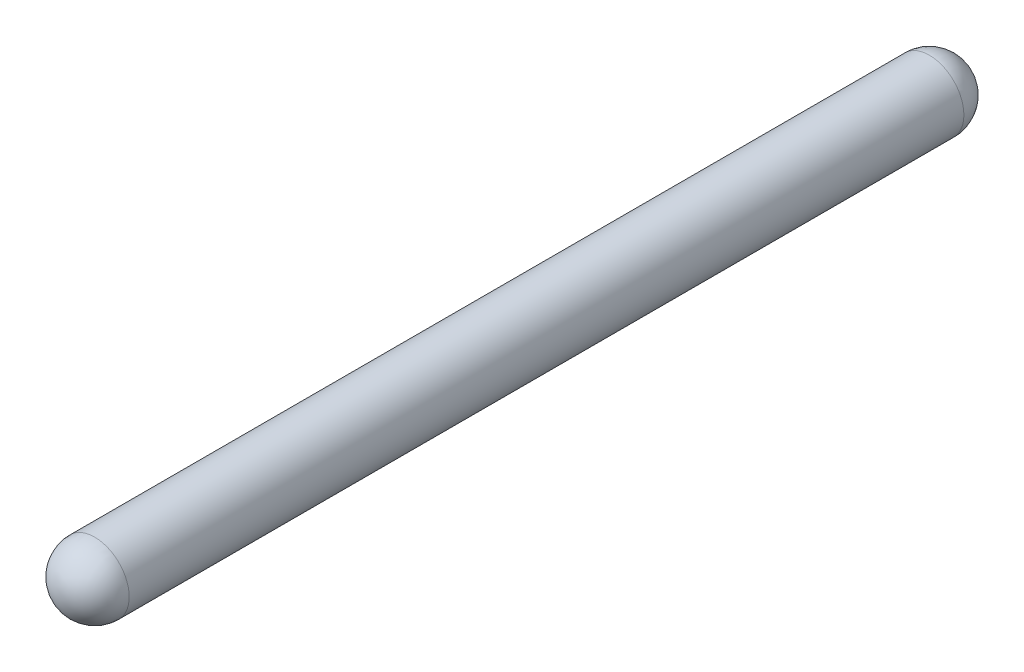
ISO-10303-21;
HEADER;
FILE_DESCRIPTION(('STEP AP214'),'2;1');
FILE_NAME('part.step','',(''),(''),'','','');
FILE_SCHEMA(('AUTOMOTIVE_DESIGN { 1 0 10303 214 1 1 1 1 }'));
ENDSEC;
DATA;
#1=APPLICATION_CONTEXT('core data for automotive mechanical design processes');
#2=APPLICATION_PROTOCOL_DEFINITION('international standard','automotive_design',2000,#1);
#3=PRODUCT_CONTEXT('',#1,'mechanical');
#4=PRODUCT('Part','Part','',(#3));
#5=PRODUCT_RELATED_PRODUCT_CATEGORY('part','',(#4));
#6=PRODUCT_DEFINITION_FORMATION('','',#4);
#7=PRODUCT_DEFINITION_CONTEXT('part definition',#1,'design');
#8=PRODUCT_DEFINITION('design','',#6,#7);
#9=PRODUCT_DEFINITION_SHAPE('','',#8);
#10=(LENGTH_UNIT() NAMED_UNIT(*) SI_UNIT(.MILLI.,.METRE.));
#11=(NAMED_UNIT(*) PLANE_ANGLE_UNIT() SI_UNIT($,.RADIAN.));
#12=(NAMED_UNIT(*) SI_UNIT($,.STERADIAN.) SOLID_ANGLE_UNIT());
#13=UNCERTAINTY_MEASURE_WITH_UNIT(LENGTH_MEASURE(1.E-05),#10,'distance_accuracy_value','');
#14=(GEOMETRIC_REPRESENTATION_CONTEXT(3) GLOBAL_UNCERTAINTY_ASSIGNED_CONTEXT((#13)) GLOBAL_UNIT_ASSIGNED_CONTEXT((#10,
#11,#12)) REPRESENTATION_CONTEXT('',''));
#15=CARTESIAN_POINT('',(0.,0.,0.));
#16=DIRECTION('',(0.,0.,1.));
#17=DIRECTION('',(1.,0.,0.));
#18=AXIS2_PLACEMENT_3D('',#15,#16,#17);
#19=CARTESIAN_POINT('',(-1.27,0.,-3.));
#20=DIRECTION('',(1.,0.,0.));
#21=DIRECTION('',(0.,-1.,0.));
#22=AXIS2_PLACEMENT_3D('',#19,#20,#21);
#23=SPHERICAL_SURFACE('',#22,0.331);
#24=CARTESIAN_POINT('',(-1.27,0.,-3.));
#25=DIRECTION('',(0.,0.,1.));
#26=DIRECTION('',(1.,0.,0.));
#27=AXIS2_PLACEMENT_3D('',#24,#25,#26);
#28=CIRCLE('',#27,0.331);
#29=CARTESIAN_POINT('',(-0.939,0.,-3.));
#30=VERTEX_POINT('',#29);
#31=CARTESIAN_POINT('',(-1.601,0.,-3.));
#32=VERTEX_POINT('',#31);
#33=EDGE_CURVE('E42',#30,#32,#28,.T.);
#34=ORIENTED_EDGE('',*,*,#33,.F.);
#35=CARTESIAN_POINT('',(-1.27,0.,-3.));
#36=DIRECTION('',(0.,0.,1.));
#37=DIRECTION('',(1.,0.,0.));
#38=AXIS2_PLACEMENT_3D('',#35,#36,#37);
#39=CIRCLE('',#38,0.331);
#40=EDGE_CURVE('E26',#32,#30,#39,.T.);
#41=ORIENTED_EDGE('',*,*,#40,.F.);
#42=EDGE_LOOP('',(#34,#41));
#43=FACE_BOUND('',#42,.T.);
#44=ADVANCED_FACE('F17',(#43),#23,.T.);
#45=CARTESIAN_POINT('',(-1.27,0.,5.));
#46=DIRECTION('',(1.,0.,0.));
#47=DIRECTION('',(0.,1.,0.));
#48=AXIS2_PLACEMENT_3D('',#45,#46,#47);
#49=SPHERICAL_SURFACE('',#48,0.331);
#50=CARTESIAN_POINT('',(-1.27,0.,5.));
#51=DIRECTION('',(0.,0.,1.));
#52=DIRECTION('',(1.,0.,0.));
#53=AXIS2_PLACEMENT_3D('',#50,#51,#52);
#54=CIRCLE('',#53,0.331);
#55=CARTESIAN_POINT('',(-0.939,0.,5.));
#56=VERTEX_POINT('',#55);
#57=CARTESIAN_POINT('',(-1.601,0.,5.));
#58=VERTEX_POINT('',#57);
#59=EDGE_CURVE('E11',#56,#58,#54,.F.);
#60=ORIENTED_EDGE('',*,*,#59,.F.);
#61=CARTESIAN_POINT('',(-1.27,0.,5.));
#62=DIRECTION('',(0.,0.,1.));
#63=DIRECTION('',(1.,0.,0.));
#64=AXIS2_PLACEMENT_3D('',#61,#62,#63);
#65=CIRCLE('',#64,0.331);
#66=EDGE_CURVE('E34',#58,#56,#65,.F.);
#67=ORIENTED_EDGE('',*,*,#66,.F.);
#68=EDGE_LOOP('',(#60,#67));
#69=FACE_BOUND('',#68,.T.);
#70=ADVANCED_FACE('F49',(#69),#49,.T.);
#71=CARTESIAN_POINT('',(-1.27,0.,-3.));
#72=DIRECTION('',(0.,0.,1.));
#73=DIRECTION('',(1.,0.,0.));
#74=AXIS2_PLACEMENT_3D('',#71,#72,#73);
#75=CYLINDRICAL_SURFACE('',#74,0.331);
#76=ORIENTED_EDGE('',*,*,#66,.T.);
#77=ORIENTED_EDGE('',*,*,#59,.T.);
#78=EDGE_LOOP('',(#76,#77));
#79=FACE_BOUND('',#78,.T.);
#80=ORIENTED_EDGE('',*,*,#40,.T.);
#81=ORIENTED_EDGE('',*,*,#33,.T.);
#82=EDGE_LOOP('',(#80,#81));
#83=FACE_BOUND('',#82,.T.);
#84=ADVANCED_FACE('F45',(#79,#83),#75,.T.);
#85=CLOSED_SHELL('',(#44,#70,#84));
#86=MANIFOLD_SOLID_BREP('B1',#85);
#87=ADVANCED_BREP_SHAPE_REPRESENTATION('',(#18,#86),#14);
#88=SHAPE_DEFINITION_REPRESENTATION(#9,#87);
ENDSEC;
END-ISO-10303-21;
